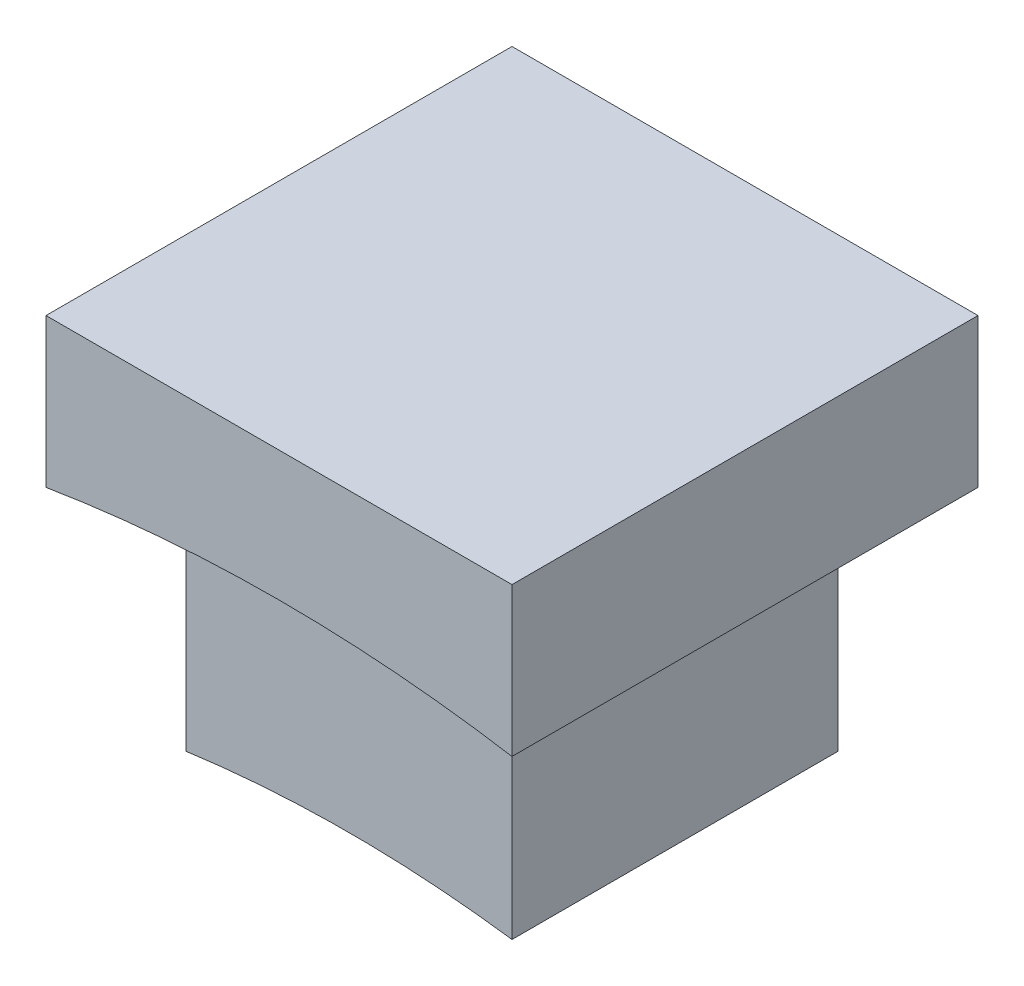
ISO-10303-21;
HEADER;
FILE_DESCRIPTION(('STEP AP214'),'2;1');
FILE_NAME('part.step','',(''),(''),'','','');
FILE_SCHEMA(('AUTOMOTIVE_DESIGN { 1 0 10303 214 1 1 1 1 }'));
ENDSEC;
DATA;
#1=APPLICATION_CONTEXT('core data for automotive mechanical design processes');
#2=APPLICATION_PROTOCOL_DEFINITION('international standard','automotive_design',2000,#1);
#3=PRODUCT_CONTEXT('',#1,'mechanical');
#4=PRODUCT('Part','Part','',(#3));
#5=PRODUCT_RELATED_PRODUCT_CATEGORY('part','',(#4));
#6=PRODUCT_DEFINITION_FORMATION('','',#4);
#7=PRODUCT_DEFINITION_CONTEXT('part definition',#1,'design');
#8=PRODUCT_DEFINITION('design','',#6,#7);
#9=PRODUCT_DEFINITION_SHAPE('','',#8);
#10=(LENGTH_UNIT() NAMED_UNIT(*) SI_UNIT(.MILLI.,.METRE.));
#11=(NAMED_UNIT(*) PLANE_ANGLE_UNIT() SI_UNIT($,.RADIAN.));
#12=(NAMED_UNIT(*) SI_UNIT($,.STERADIAN.) SOLID_ANGLE_UNIT());
#13=UNCERTAINTY_MEASURE_WITH_UNIT(LENGTH_MEASURE(1.E-05),#10,'distance_accuracy_value','');
#14=(GEOMETRIC_REPRESENTATION_CONTEXT(3) GLOBAL_UNCERTAINTY_ASSIGNED_CONTEXT((#13)) GLOBAL_UNIT_ASSIGNED_CONTEXT((#10,
#11,#12)) REPRESENTATION_CONTEXT('',''));
#15=CARTESIAN_POINT('',(0.,0.,0.));
#16=DIRECTION('',(0.,0.,1.));
#17=DIRECTION('',(1.,0.,0.));
#18=AXIS2_PLACEMENT_3D('',#15,#16,#17);
#19=CARTESIAN_POINT('',(7.,10.,7.));
#20=DIRECTION('',(-1.,0.,0.));
#21=DIRECTION('',(0.,0.,1.));
#22=AXIS2_PLACEMENT_3D('',#19,#20,#21);
#23=PLANE('',#22);
#24=DIRECTION('',(0.,-1.,0.));
#25=VECTOR('',#24,1.);
#26=CARTESIAN_POINT('',(7.,10.,7.));
#27=LINE('',#26,#25);
#28=CARTESIAN_POINT('',(7.,10.,7.));
#29=VERTEX_POINT('',#28);
#30=CARTESIAN_POINT('',(7.,5.52775564263884,7.));
#31=VERTEX_POINT('',#30);
#32=EDGE_CURVE('E158',#29,#31,#27,.T.);
#33=ORIENTED_EDGE('',*,*,#32,.T.);
#34=DIRECTION('',(0.,0.,1.));
#35=VECTOR('',#34,1.);
#36=CARTESIAN_POINT('',(7.,5.52775564263884,-7.));
#37=LINE('',#36,#35);
#38=CARTESIAN_POINT('',(7.,5.52775564263884,-7.));
#39=VERTEX_POINT('',#38);
#40=EDGE_CURVE('E141',#31,#39,#37,.F.);
#41=ORIENTED_EDGE('',*,*,#40,.T.);
#42=DIRECTION('',(0.,-1.,0.));
#43=VECTOR('',#42,1.);
#44=CARTESIAN_POINT('',(7.,10.,-7.));
#45=LINE('',#44,#43);
#46=CARTESIAN_POINT('',(7.,10.,-7.));
#47=VERTEX_POINT('',#46);
#48=EDGE_CURVE('E170',#47,#39,#45,.T.);
#49=ORIENTED_EDGE('',*,*,#48,.F.);
#50=DIRECTION('',(0.,0.,-1.));
#51=VECTOR('',#50,1.);
#52=CARTESIAN_POINT('',(7.,10.,7.));
#53=LINE('',#52,#51);
#54=EDGE_CURVE('E145',#29,#47,#53,.T.);
#55=ORIENTED_EDGE('',*,*,#54,.F.);
#56=EDGE_LOOP('',(#33,#41,#49,#55));
#57=FACE_BOUND('',#56,.T.);
#58=ADVANCED_FACE('F43',(#57),#23,.F.);
#59=CARTESIAN_POINT('',(-7.,10.,-7.));
#60=DIRECTION('',(0.,0.,1.));
#61=DIRECTION('',(1.,0.,0.));
#62=AXIS2_PLACEMENT_3D('',#59,#60,#61);
#63=PLANE('',#62);
#64=ORIENTED_EDGE('',*,*,#48,.T.);
#65=CARTESIAN_POINT('',(0.,-37.,-7.));
#66=DIRECTION('',(0.,0.,1.));
#67=DIRECTION('',(1.,0.,0.));
#68=AXIS2_PLACEMENT_3D('',#65,#66,#67);
#69=CIRCLE('',#68,43.1);
#70=CARTESIAN_POINT('',(-7.,5.52775564263884,-7.));
#71=VERTEX_POINT('',#70);
#72=EDGE_CURVE('E133',#39,#71,#69,.T.);
#73=ORIENTED_EDGE('',*,*,#72,.T.);
#74=DIRECTION('',(0.,-1.,0.));
#75=VECTOR('',#74,1.);
#76=CARTESIAN_POINT('',(-7.,10.,-7.));
#77=LINE('',#76,#75);
#78=CARTESIAN_POINT('',(-7.,10.,-7.));
#79=VERTEX_POINT('',#78);
#80=EDGE_CURVE('E166',#79,#71,#77,.T.);
#81=ORIENTED_EDGE('',*,*,#80,.F.);
#82=DIRECTION('',(-1.,0.,0.));
#83=VECTOR('',#82,1.);
#84=CARTESIAN_POINT('',(-7.,10.,-7.));
#85=LINE('',#84,#83);
#86=EDGE_CURVE('E149',#47,#79,#85,.T.);
#87=ORIENTED_EDGE('',*,*,#86,.F.);
#88=EDGE_LOOP('',(#64,#73,#81,#87));
#89=FACE_BOUND('',#88,.T.);
#90=ADVANCED_FACE('F209',(#89),#63,.F.);
#91=CARTESIAN_POINT('',(-7.,10.,7.));
#92=DIRECTION('',(1.,0.,0.));
#93=DIRECTION('',(0.,0.,-1.));
#94=AXIS2_PLACEMENT_3D('',#91,#92,#93);
#95=PLANE('',#94);
#96=ORIENTED_EDGE('',*,*,#80,.T.);
#97=DIRECTION('',(0.,0.,1.));
#98=VECTOR('',#97,1.);
#99=CARTESIAN_POINT('',(-7.,5.52775564263884,-7.));
#100=LINE('',#99,#98);
#101=CARTESIAN_POINT('',(-7.,5.52775564263884,7.));
#102=VERTEX_POINT('',#101);
#103=EDGE_CURVE('E137',#71,#102,#100,.T.);
#104=ORIENTED_EDGE('',*,*,#103,.T.);
#105=DIRECTION('',(0.,-1.,0.));
#106=VECTOR('',#105,1.);
#107=CARTESIAN_POINT('',(-7.,10.,7.));
#108=LINE('',#107,#106);
#109=CARTESIAN_POINT('',(-7.,10.,7.));
#110=VERTEX_POINT('',#109);
#111=EDGE_CURVE('E162',#110,#102,#108,.T.);
#112=ORIENTED_EDGE('',*,*,#111,.F.);
#113=DIRECTION('',(0.,0.,1.));
#114=VECTOR('',#113,1.);
#115=CARTESIAN_POINT('',(-7.,10.,7.));
#116=LINE('',#115,#114);
#117=EDGE_CURVE('E152',#79,#110,#116,.T.);
#118=ORIENTED_EDGE('',*,*,#117,.F.);
#119=EDGE_LOOP('',(#96,#104,#112,#118));
#120=FACE_BOUND('',#119,.T.);
#121=ADVANCED_FACE('F214',(#120),#95,.F.);
#122=CARTESIAN_POINT('',(-7.,10.,7.));
#123=DIRECTION('',(0.,0.,-1.));
#124=DIRECTION('',(-1.,0.,0.));
#125=AXIS2_PLACEMENT_3D('',#122,#123,#124);
#126=PLANE('',#125);
#127=ORIENTED_EDGE('',*,*,#111,.T.);
#128=CARTESIAN_POINT('',(0.,-37.,7.));
#129=DIRECTION('',(0.,0.,1.));
#130=DIRECTION('',(1.,0.,0.));
#131=AXIS2_PLACEMENT_3D('',#128,#129,#130);
#132=CIRCLE('',#131,43.1);
#133=EDGE_CURVE('E130',#31,#102,#132,.T.);
#134=ORIENTED_EDGE('',*,*,#133,.F.);
#135=ORIENTED_EDGE('',*,*,#32,.F.);
#136=DIRECTION('',(1.,0.,0.));
#137=VECTOR('',#136,1.);
#138=CARTESIAN_POINT('',(-7.,10.,7.));
#139=LINE('',#138,#137);
#140=EDGE_CURVE('E155',#110,#29,#139,.T.);
#141=ORIENTED_EDGE('',*,*,#140,.F.);
#142=EDGE_LOOP('',(#127,#134,#135,#141));
#143=FACE_BOUND('',#142,.T.);
#144=ADVANCED_FACE('F222',(#143),#126,.F.);
#145=CARTESIAN_POINT('',(0.,10.,0.));
#146=DIRECTION('',(0.,-1.,0.));
#147=DIRECTION('',(0.,0.,-1.));
#148=AXIS2_PLACEMENT_3D('',#145,#146,#147);
#149=PLANE('',#148);
#150=ORIENTED_EDGE('',*,*,#54,.T.);
#151=ORIENTED_EDGE('',*,*,#86,.T.);
#152=ORIENTED_EDGE('',*,*,#117,.T.);
#153=ORIENTED_EDGE('',*,*,#140,.T.);
#154=EDGE_LOOP('',(#150,#151,#152,#153));
#155=FACE_BOUND('',#154,.T.);
#156=ADVANCED_FACE('F228',(#155),#149,.F.);
#157=CARTESIAN_POINT('',(0.,-37.,-7.));
#158=DIRECTION('',(0.,0.,1.));
#159=DIRECTION('',(1.,0.,0.));
#160=AXIS2_PLACEMENT_3D('',#157,#158,#159);
#161=CYLINDRICAL_SURFACE('',#160,43.1);
#162=CARTESIAN_POINT('',(0.,-37.,4.9));
#163=DIRECTION('',(0.,0.,1.));
#164=DIRECTION('',(1.,0.,0.));
#165=AXIS2_PLACEMENT_3D('',#162,#163,#164);
#166=CIRCLE('',#165,43.1);
#167=CARTESIAN_POINT('',(-4.9,5.82055581143243,4.9));
#168=VERTEX_POINT('',#167);
#169=CARTESIAN_POINT('',(4.9,5.82055581143243,4.9));
#170=VERTEX_POINT('',#169);
#171=EDGE_CURVE('E180',#168,#170,#166,.F.);
#172=ORIENTED_EDGE('',*,*,#171,.T.);
#173=DIRECTION('',(0.,0.,1.));
#174=VECTOR('',#173,1.);
#175=CARTESIAN_POINT('',(4.9,5.82055581143243,-7.));
#176=LINE('',#175,#174);
#177=CARTESIAN_POINT('',(4.9,5.82055581143243,-4.9));
#178=VERTEX_POINT('',#177);
#179=EDGE_CURVE('E51',#170,#178,#176,.F.);
#180=ORIENTED_EDGE('',*,*,#179,.T.);
#181=CARTESIAN_POINT('',(0.,-37.,-4.9));
#182=DIRECTION('',(0.,0.,-1.));
#183=DIRECTION('',(-1.,0.,0.));
#184=AXIS2_PLACEMENT_3D('',#181,#182,#183);
#185=CIRCLE('',#184,43.1);
#186=CARTESIAN_POINT('',(-4.9,5.82055581143243,-4.9));
#187=VERTEX_POINT('',#186);
#188=EDGE_CURVE('E121',#178,#187,#185,.F.);
#189=ORIENTED_EDGE('',*,*,#188,.T.);
#190=DIRECTION('',(0.,0.,1.));
#191=VECTOR('',#190,1.);
#192=CARTESIAN_POINT('',(-4.9,5.82055581143243,-7.));
#193=LINE('',#192,#191);
#194=EDGE_CURVE('E176',#187,#168,#193,.T.);
#195=ORIENTED_EDGE('',*,*,#194,.T.);
#196=EDGE_LOOP('',(#172,#180,#189,#195));
#197=FACE_BOUND('',#196,.T.);
#198=ORIENTED_EDGE('',*,*,#133,.T.);
#199=ORIENTED_EDGE('',*,*,#103,.F.);
#200=ORIENTED_EDGE('',*,*,#72,.F.);
#201=ORIENTED_EDGE('',*,*,#40,.F.);
#202=EDGE_LOOP('',(#198,#199,#200,#201));
#203=FACE_BOUND('',#202,.T.);
#204=ADVANCED_FACE('F185',(#197,#203),#161,.F.);
#205=CARTESIAN_POINT('',(4.9,-5.,4.9));
#206=DIRECTION('',(1.,0.,0.));
#207=DIRECTION('',(0.,0.,-1.));
#208=AXIS2_PLACEMENT_3D('',#205,#206,#207);
#209=PLANE('',#208);
#210=DIRECTION('',(0.,0.,1.));
#211=VECTOR('',#210,1.);
#212=CARTESIAN_POINT('',(4.9,-1.33503119306005,-7.));
#213=LINE('',#212,#211);
#214=CARTESIAN_POINT('',(4.9,-1.33503119306005,-4.9));
#215=VERTEX_POINT('',#214);
#216=CARTESIAN_POINT('',(4.9,-1.33503119306005,4.9));
#217=VERTEX_POINT('',#216);
#218=EDGE_CURVE('E107',#215,#217,#213,.T.);
#219=ORIENTED_EDGE('',*,*,#218,.F.);
#220=DIRECTION('',(0.,1.,0.));
#221=VECTOR('',#220,1.);
#222=CARTESIAN_POINT('',(4.9,-5.,-4.9));
#223=LINE('',#222,#221);
#224=EDGE_CURVE('E114',#215,#178,#223,.T.);
#225=ORIENTED_EDGE('',*,*,#224,.T.);
#226=ORIENTED_EDGE('',*,*,#179,.F.);
#227=DIRECTION('',(0.,1.,0.));
#228=VECTOR('',#227,1.);
#229=CARTESIAN_POINT('',(4.9,-5.,4.9));
#230=LINE('',#229,#228);
#231=EDGE_CURVE('E115',#217,#170,#230,.T.);
#232=ORIENTED_EDGE('',*,*,#231,.F.);
#233=EDGE_LOOP('',(#219,#225,#226,#232));
#234=FACE_BOUND('',#233,.T.);
#235=ADVANCED_FACE('F112',(#234),#209,.T.);
#236=CARTESIAN_POINT('',(-4.9,-5.,4.9));
#237=DIRECTION('',(0.,0.,1.));
#238=DIRECTION('',(1.,0.,0.));
#239=AXIS2_PLACEMENT_3D('',#236,#237,#238);
#240=PLANE('',#239);
#241=CARTESIAN_POINT('',(0.,-37.,4.9));
#242=DIRECTION('',(0.,0.,1.));
#243=DIRECTION('',(1.,0.,0.));
#244=AXIS2_PLACEMENT_3D('',#241,#242,#243);
#245=CIRCLE('',#244,36.);
#246=CARTESIAN_POINT('',(-4.9,-1.33503119306005,4.9));
#247=VERTEX_POINT('',#246);
#248=EDGE_CURVE('E117',#217,#247,#245,.T.);
#249=ORIENTED_EDGE('',*,*,#248,.F.);
#250=ORIENTED_EDGE('',*,*,#231,.T.);
#251=ORIENTED_EDGE('',*,*,#171,.F.);
#252=DIRECTION('',(0.,1.,0.));
#253=VECTOR('',#252,1.);
#254=CARTESIAN_POINT('',(-4.9,-5.,4.9));
#255=LINE('',#254,#253);
#256=EDGE_CURVE('E126',#247,#168,#255,.T.);
#257=ORIENTED_EDGE('',*,*,#256,.F.);
#258=EDGE_LOOP('',(#249,#250,#251,#257));
#259=FACE_BOUND('',#258,.T.);
#260=ADVANCED_FACE('F190',(#259),#240,.T.);
#261=CARTESIAN_POINT('',(-4.9,-5.,4.9));
#262=DIRECTION('',(-1.,0.,0.));
#263=DIRECTION('',(0.,0.,1.));
#264=AXIS2_PLACEMENT_3D('',#261,#262,#263);
#265=PLANE('',#264);
#266=DIRECTION('',(0.,0.,1.));
#267=VECTOR('',#266,1.);
#268=CARTESIAN_POINT('',(-4.9,-1.33503119306005,-7.));
#269=LINE('',#268,#267);
#270=CARTESIAN_POINT('',(-4.9,-1.33503119306005,-4.9));
#271=VERTEX_POINT('',#270);
#272=EDGE_CURVE('E57',#247,#271,#269,.F.);
#273=ORIENTED_EDGE('',*,*,#272,.F.);
#274=ORIENTED_EDGE('',*,*,#256,.T.);
#275=ORIENTED_EDGE('',*,*,#194,.F.);
#276=DIRECTION('',(0.,1.,0.));
#277=VECTOR('',#276,1.);
#278=CARTESIAN_POINT('',(-4.9,-5.,-4.9));
#279=LINE('',#278,#277);
#280=EDGE_CURVE('E64',#271,#187,#279,.T.);
#281=ORIENTED_EDGE('',*,*,#280,.F.);
#282=EDGE_LOOP('',(#273,#274,#275,#281));
#283=FACE_BOUND('',#282,.T.);
#284=ADVANCED_FACE('F199',(#283),#265,.T.);
#285=CARTESIAN_POINT('',(-4.9,-5.,-4.9));
#286=DIRECTION('',(0.,0.,-1.));
#287=DIRECTION('',(-1.,0.,0.));
#288=AXIS2_PLACEMENT_3D('',#285,#286,#287);
#289=PLANE('',#288);
#290=CARTESIAN_POINT('',(0.,-37.,-4.9));
#291=DIRECTION('',(0.,0.,-1.));
#292=DIRECTION('',(-1.,0.,0.));
#293=AXIS2_PLACEMENT_3D('',#290,#291,#292);
#294=CIRCLE('',#293,36.);
#295=EDGE_CURVE('E11',#271,#215,#294,.T.);
#296=ORIENTED_EDGE('',*,*,#295,.F.);
#297=ORIENTED_EDGE('',*,*,#280,.T.);
#298=ORIENTED_EDGE('',*,*,#188,.F.);
#299=ORIENTED_EDGE('',*,*,#224,.F.);
#300=EDGE_LOOP('',(#296,#297,#298,#299));
#301=FACE_BOUND('',#300,.T.);
#302=ADVANCED_FACE('F119',(#301),#289,.T.);
#303=CARTESIAN_POINT('',(0.,-37.,-7.));
#304=DIRECTION('',(0.,0.,1.));
#305=DIRECTION('',(1.,0.,0.));
#306=AXIS2_PLACEMENT_3D('',#303,#304,#305);
#307=CYLINDRICAL_SURFACE('',#306,36.);
#308=ORIENTED_EDGE('',*,*,#218,.T.);
#309=ORIENTED_EDGE('',*,*,#248,.T.);
#310=ORIENTED_EDGE('',*,*,#272,.T.);
#311=ORIENTED_EDGE('',*,*,#295,.T.);
#312=EDGE_LOOP('',(#308,#309,#310,#311));
#313=FACE_BOUND('',#312,.T.);
#314=ADVANCED_FACE('F106',(#313),#307,.F.);
#315=CLOSED_SHELL('',(#58,#90,#121,#144,#156,#204,#235,#260,#284,#302,#314));
#316=MANIFOLD_SOLID_BREP('B2',#315);
#317=ADVANCED_BREP_SHAPE_REPRESENTATION('',(#18,#316),#14);
#318=SHAPE_DEFINITION_REPRESENTATION(#9,#317);
ENDSEC;
END-ISO-10303-21;
